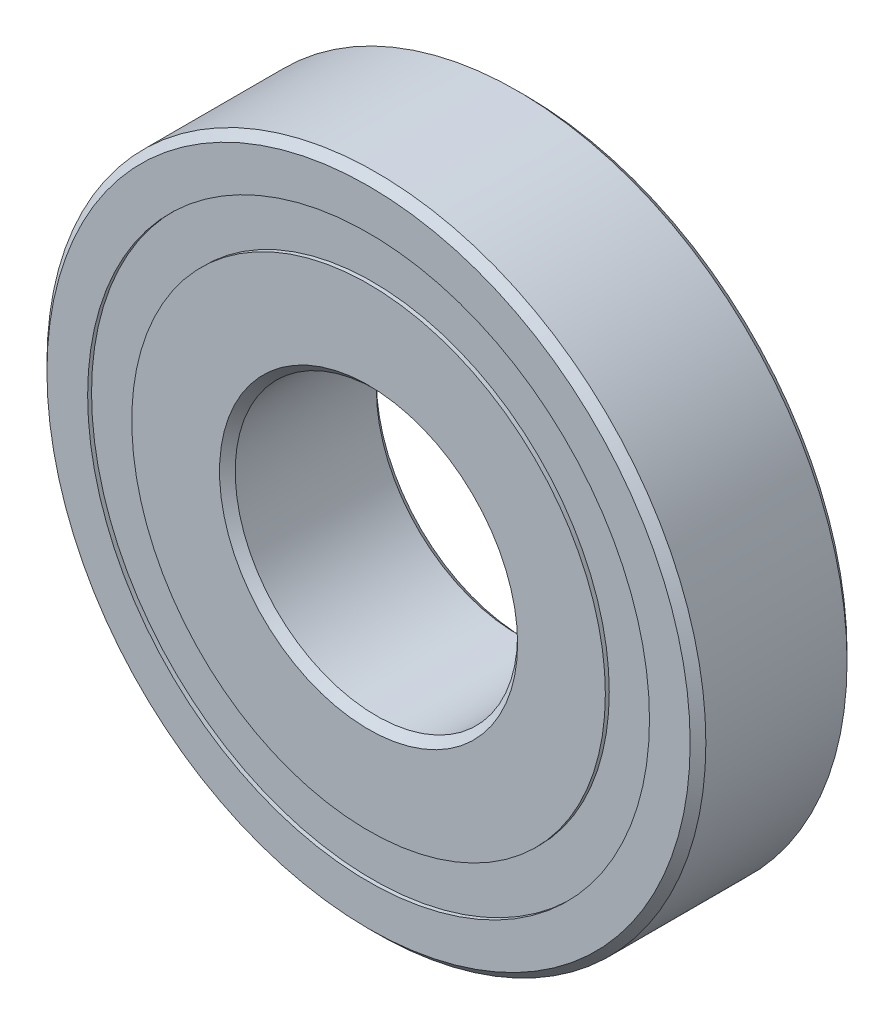
ISO-10303-21;
HEADER;
FILE_DESCRIPTION(('STEP AP214'),'2;1');
FILE_NAME('part.step','',(''),(''),'','','');
FILE_SCHEMA(('AUTOMOTIVE_DESIGN { 1 0 10303 214 1 1 1 1 }'));
ENDSEC;
DATA;
#1=APPLICATION_CONTEXT('core data for automotive mechanical design processes');
#2=APPLICATION_PROTOCOL_DEFINITION('international standard','automotive_design',2000,#1);
#3=PRODUCT_CONTEXT('',#1,'mechanical');
#4=PRODUCT('Part','Part','',(#3));
#5=PRODUCT_RELATED_PRODUCT_CATEGORY('part','',(#4));
#6=PRODUCT_DEFINITION_FORMATION('','',#4);
#7=PRODUCT_DEFINITION_CONTEXT('part definition',#1,'design');
#8=PRODUCT_DEFINITION('design','',#6,#7);
#9=PRODUCT_DEFINITION_SHAPE('','',#8);
#10=(LENGTH_UNIT() NAMED_UNIT(*) SI_UNIT(.MILLI.,.METRE.));
#11=(NAMED_UNIT(*) PLANE_ANGLE_UNIT() SI_UNIT($,.RADIAN.));
#12=(NAMED_UNIT(*) SI_UNIT($,.STERADIAN.) SOLID_ANGLE_UNIT());
#13=UNCERTAINTY_MEASURE_WITH_UNIT(LENGTH_MEASURE(1.E-05),#10,'distance_accuracy_value','');
#14=(GEOMETRIC_REPRESENTATION_CONTEXT(3) GLOBAL_UNCERTAINTY_ASSIGNED_CONTEXT((#13)) GLOBAL_UNIT_ASSIGNED_CONTEXT((#10,
#11,#12)) REPRESENTATION_CONTEXT('',''));
#15=CARTESIAN_POINT('',(0.,0.,0.));
#16=DIRECTION('',(0.,0.,1.));
#17=DIRECTION('',(1.,0.,0.));
#18=AXIS2_PLACEMENT_3D('',#15,#16,#17);
#19=CARTESIAN_POINT('',(-7.14470958122166,-4.12499999999993,0.));
#20=DIRECTION('',(-0.866025403784443,-0.499999999999992,0.));
#21=DIRECTION('',(0.,0.,-1.));
#22=AXIS2_PLACEMENT_3D('',#19,#20,#21);
#23=SPHERICAL_SURFACE('',#22,1.31498827146959);
#24=CARTESIAN_POINT('',(-8.28352282999291,-4.78249413573472,0.));
#25=VERTEX_POINT('',#24);
#26=VERTEX_LOOP('',#25);
#27=FACE_BOUND('',#26,.T.);
#28=CARTESIAN_POINT('',(-6.0058963324504,-3.46750586426515,0.));
#29=VERTEX_POINT('',#28);
#30=VERTEX_LOOP('',#29);
#31=FACE_BOUND('',#30,.T.);
#32=ADVANCED_FACE('P0_F15',(#27,#31),#23,.T.);
#33=CLOSED_SHELL('',(#32));
#34=MANIFOLD_SOLID_BREP('P0_B1',#33);
#35=CARTESIAN_POINT('',(-4.12499999999991,7.14470958122167,0.));
#36=DIRECTION('',(-0.499999999999989,0.866025403784445,0.));
#37=DIRECTION('',(0.,0.,-1.));
#38=AXIS2_PLACEMENT_3D('',#35,#36,#37);
#39=SPHERICAL_SURFACE('',#38,1.31498827146959);
#40=CARTESIAN_POINT('',(-4.78249413573469,8.28352282999293,0.));
#41=VERTEX_POINT('',#40);
#42=VERTEX_LOOP('',#41);
#43=FACE_BOUND('',#42,.T.);
#44=CARTESIAN_POINT('',(-3.46750586426513,6.00589633245041,0.));
#45=VERTEX_POINT('',#44);
#46=VERTEX_LOOP('',#45);
#47=FACE_BOUND('',#46,.T.);
#48=ADVANCED_FACE('P1_F15',(#43,#47),#39,.T.);
#49=CLOSED_SHELL('',(#48));
#50=MANIFOLD_SOLID_BREP('P1_B1',#49);
#51=CARTESIAN_POINT('',(4.12500000000001,7.14470958122162,0.));
#52=DIRECTION('',(0.500000000000001,0.866025403784438,0.));
#53=DIRECTION('',(0.,0.,-1.));
#54=AXIS2_PLACEMENT_3D('',#51,#52,#53);
#55=SPHERICAL_SURFACE('',#54,1.31498827146959);
#56=CARTESIAN_POINT('',(3.46750586426521,6.00589633245036,0.));
#57=VERTEX_POINT('',#56);
#58=VERTEX_LOOP('',#57);
#59=FACE_BOUND('',#58,.T.);
#60=CARTESIAN_POINT('',(4.78249413573481,8.28352282999287,0.));
#61=VERTEX_POINT('',#60);
#62=VERTEX_LOOP('',#61);
#63=FACE_BOUND('',#62,.T.);
#64=ADVANCED_FACE('P2_F15',(#59,#63),#55,.T.);
#65=CLOSED_SHELL('',(#64));
#66=MANIFOLD_SOLID_BREP('P2_B1',#65);
#67=CARTESIAN_POINT('',(-7.14470958122157,4.12500000000008,0.));
#68=DIRECTION('',(-0.866025403784433,0.500000000000011,0.));
#69=DIRECTION('',(0.,0.,-1.));
#70=AXIS2_PLACEMENT_3D('',#67,#68,#69);
#71=SPHERICAL_SURFACE('',#70,1.31498827146959);
#72=CARTESIAN_POINT('',(-6.00589633245033,3.46750586426528,0.));
#73=VERTEX_POINT('',#72);
#74=VERTEX_LOOP('',#73);
#75=FACE_BOUND('',#74,.T.);
#76=CARTESIAN_POINT('',(-8.28352282999281,4.78249413573489,0.));
#77=VERTEX_POINT('',#76);
#78=VERTEX_LOOP('',#77);
#79=FACE_BOUND('',#78,.T.);
#80=ADVANCED_FACE('P3_F15',(#75,#79),#71,.T.);
#81=CLOSED_SHELL('',(#80));
#82=MANIFOLD_SOLID_BREP('P3_B1',#81);
#83=CARTESIAN_POINT('',(0.,8.9532967032967,-1.31498827146959));
#84=DIRECTION('',(0.,0.,-1.));
#85=DIRECTION('',(-1.,0.,0.));
#86=AXIS2_PLACEMENT_3D('',#83,#84,#85);
#87=PLANE('',#86);
#88=CARTESIAN_POINT('',(0.,0.,-1.31498827146959));
#89=DIRECTION('',(0.,0.,1.));
#90=DIRECTION('',(1.,0.,0.));
#91=AXIS2_PLACEMENT_3D('',#88,#89,#90);
#92=CIRCLE('',#91,8.9532967032967);
#93=CARTESIAN_POINT('',(8.9532967032967,0.,-1.31498827146959));
#94=VERTEX_POINT('',#93);
#95=EDGE_CURVE('P4_E17',#94,#94,#92,.F.);
#96=ORIENTED_EDGE('',*,*,#95,.F.);
#97=EDGE_LOOP('',(#96));
#98=FACE_BOUND('',#97,.T.);
#99=CARTESIAN_POINT('',(0.,0.,-1.31498827146959));
#100=DIRECTION('',(0.,0.,1.));
#101=DIRECTION('',(1.,0.,0.));
#102=AXIS2_PLACEMENT_3D('',#99,#100,#101);
#103=CIRCLE('',#102,7.5467032967033);
#104=CARTESIAN_POINT('',(7.5467032967033,0.,-1.31498827146959));
#105=VERTEX_POINT('',#104);
#106=EDGE_CURVE('P4_E26',#105,#105,#103,.F.);
#107=ORIENTED_EDGE('',*,*,#106,.T.);
#108=EDGE_LOOP('',(#107));
#109=FACE_BOUND('',#108,.T.);
#110=ADVANCED_FACE('P4_F14',(#98,#109),#87,.F.);
#111=CARTESIAN_POINT('',(0.,0.,2.5));
#112=DIRECTION('',(0.,0.,1.));
#113=DIRECTION('',(1.,0.,0.));
#114=AXIS2_PLACEMENT_3D('',#111,#112,#113);
#115=CYLINDRICAL_SURFACE('',#114,8.9532967032967);
#116=ORIENTED_EDGE('',*,*,#95,.T.);
#117=EDGE_LOOP('',(#116));
#118=FACE_BOUND('',#117,.T.);
#119=CARTESIAN_POINT('',(0.,0.,-2.375));
#120=DIRECTION('',(0.,0.,1.));
#121=DIRECTION('',(1.,0.,0.));
#122=AXIS2_PLACEMENT_3D('',#119,#120,#121);
#123=CIRCLE('',#122,8.9532967032967);
#124=CARTESIAN_POINT('',(8.9532967032967,0.,-2.375));
#125=VERTEX_POINT('',#124);
#126=EDGE_CURVE('P4_E21',#125,#125,#123,.T.);
#127=ORIENTED_EDGE('',*,*,#126,.T.);
#128=EDGE_LOOP('',(#127));
#129=FACE_BOUND('',#128,.T.);
#130=ADVANCED_FACE('P4_F34',(#118,#129),#115,.T.);
#131=CARTESIAN_POINT('',(0.,0.,2.5));
#132=DIRECTION('',(0.,0.,1.));
#133=DIRECTION('',(1.,0.,0.));
#134=AXIS2_PLACEMENT_3D('',#131,#132,#133);
#135=CYLINDRICAL_SURFACE('',#134,7.5467032967033);
#136=CARTESIAN_POINT('',(0.,0.,-2.375));
#137=DIRECTION('',(0.,0.,1.));
#138=DIRECTION('',(1.,0.,0.));
#139=AXIS2_PLACEMENT_3D('',#136,#137,#138);
#140=CIRCLE('',#139,7.5467032967033);
#141=CARTESIAN_POINT('',(7.5467032967033,0.,-2.375));
#142=VERTEX_POINT('',#141);
#143=EDGE_CURVE('P4_E10',#142,#142,#140,.F.);
#144=ORIENTED_EDGE('',*,*,#143,.T.);
#145=EDGE_LOOP('',(#144));
#146=FACE_BOUND('',#145,.T.);
#147=ORIENTED_EDGE('',*,*,#106,.F.);
#148=EDGE_LOOP('',(#147));
#149=FACE_BOUND('',#148,.T.);
#150=ADVANCED_FACE('P4_F42',(#146,#149),#135,.F.);
#151=CARTESIAN_POINT('',(0.,8.9532967032967,-2.375));
#152=DIRECTION('',(0.,0.,1.));
#153=DIRECTION('',(1.,0.,0.));
#154=AXIS2_PLACEMENT_3D('',#151,#152,#153);
#155=PLANE('',#154);
#156=ORIENTED_EDGE('',*,*,#143,.F.);
#157=EDGE_LOOP('',(#156));
#158=FACE_BOUND('',#157,.T.);
#159=ORIENTED_EDGE('',*,*,#126,.F.);
#160=EDGE_LOOP('',(#159));
#161=FACE_BOUND('',#160,.T.);
#162=ADVANCED_FACE('P4_F43',(#158,#161),#155,.F.);
#163=CLOSED_SHELL('',(#110,#130,#150,#162));
#164=MANIFOLD_SOLID_BREP('P4_B1',#163);
#165=CARTESIAN_POINT('',(0.,0.,0.));
#166=DIRECTION('',(0.,0.,1.));
#167=DIRECTION('',(1.,0.,0.));
#168=AXIS2_PLACEMENT_3D('',#165,#166,#167);
#169=TOROIDAL_SURFACE('',#168,8.25,1.31498827146959);
#170=CARTESIAN_POINT('',(0.,0.,-1.11111111111111));
#171=DIRECTION('',(0.,0.,1.));
#172=DIRECTION('',(1.,0.,0.));
#173=AXIS2_PLACEMENT_3D('',#170,#171,#172);
#174=CIRCLE('',#173,8.9532967032967);
#175=CARTESIAN_POINT('',(8.9532967032967,0.,-1.11111111111111));
#176=VERTEX_POINT('',#175);
#177=EDGE_CURVE('P5_E32',#176,#176,#174,.F.);
#178=ORIENTED_EDGE('',*,*,#177,.T.);
#179=EDGE_LOOP('',(#178));
#180=FACE_BOUND('',#179,.T.);
#181=CARTESIAN_POINT('',(0.,0.,1.11111111111111));
#182=DIRECTION('',(0.,0.,1.));
#183=DIRECTION('',(1.,0.,0.));
#184=AXIS2_PLACEMENT_3D('',#181,#182,#183);
#185=CIRCLE('',#184,8.9532967032967);
#186=CARTESIAN_POINT('',(8.9532967032967,0.,1.11111111111111));
#187=VERTEX_POINT('',#186);
#188=EDGE_CURVE('P5_E30',#187,#187,#185,.T.);
#189=ORIENTED_EDGE('',*,*,#188,.T.);
#190=EDGE_LOOP('',(#189));
#191=FACE_BOUND('',#190,.T.);
#192=ADVANCED_FACE('P5_F14',(#180,#191),#169,.F.);
#193=CARTESIAN_POINT('',(0.,0.,2.5));
#194=DIRECTION('',(0.,0.,1.));
#195=DIRECTION('',(1.,0.,0.));
#196=AXIS2_PLACEMENT_3D('',#193,#194,#195);
#197=CYLINDRICAL_SURFACE('',#196,8.9532967032967);
#198=CARTESIAN_POINT('',(0.,0.,-2.50000000000001));
#199=DIRECTION('',(0.,0.,1.));
#200=DIRECTION('',(1.,0.,0.));
#201=AXIS2_PLACEMENT_3D('',#198,#199,#200);
#202=CIRCLE('',#201,8.9532967032967);
#203=CARTESIAN_POINT('',(8.9532967032967,0.,-2.50000000000001));
#204=VERTEX_POINT('',#203);
#205=EDGE_CURVE('P5_E18',#204,#204,#202,.F.);
#206=ORIENTED_EDGE('',*,*,#205,.T.);
#207=EDGE_LOOP('',(#206));
#208=FACE_BOUND('',#207,.T.);
#209=ORIENTED_EDGE('',*,*,#177,.F.);
#210=EDGE_LOOP('',(#209));
#211=FACE_BOUND('',#210,.T.);
#212=ADVANCED_FACE('P5_F48',(#208,#211),#197,.F.);
#213=CARTESIAN_POINT('',(0.,0.,2.5));
#214=DIRECTION('',(0.,0.,1.));
#215=DIRECTION('',(1.,0.,0.));
#216=AXIS2_PLACEMENT_3D('',#213,#214,#215);
#217=CYLINDRICAL_SURFACE('',#216,8.9532967032967);
#218=ORIENTED_EDGE('',*,*,#188,.F.);
#219=EDGE_LOOP('',(#218));
#220=FACE_BOUND('',#219,.T.);
#221=CARTESIAN_POINT('',(0.,0.,2.5));
#222=DIRECTION('',(0.,0.,1.));
#223=DIRECTION('',(1.,0.,0.));
#224=AXIS2_PLACEMENT_3D('',#221,#222,#223);
#225=CIRCLE('',#224,8.9532967032967);
#226=CARTESIAN_POINT('',(8.9532967032967,0.,2.5));
#227=VERTEX_POINT('',#226);
#228=EDGE_CURVE('P5_E41',#227,#227,#225,.T.);
#229=ORIENTED_EDGE('',*,*,#228,.T.);
#230=EDGE_LOOP('',(#229));
#231=FACE_BOUND('',#230,.T.);
#232=ADVANCED_FACE('P5_F55',(#220,#231),#217,.F.);
#233=CARTESIAN_POINT('',(0.,10.25,-2.50000000000001));
#234=DIRECTION('',(0.,0.,1.));
#235=DIRECTION('',(1.,0.,0.));
#236=AXIS2_PLACEMENT_3D('',#233,#234,#235);
#237=PLANE('',#236);
#238=ORIENTED_EDGE('',*,*,#205,.F.);
#239=EDGE_LOOP('',(#238));
#240=FACE_BOUND('',#239,.T.);
#241=CARTESIAN_POINT('',(0.,0.,-2.50000000000001));
#242=DIRECTION('',(0.,0.,1.));
#243=DIRECTION('',(1.,0.,0.));
#244=AXIS2_PLACEMENT_3D('',#241,#242,#243);
#245=CIRCLE('',#244,10.25);
#246=CARTESIAN_POINT('',(10.25,0.,-2.50000000000001));
#247=VERTEX_POINT('',#246);
#248=EDGE_CURVE('P5_E39',#247,#247,#245,.T.);
#249=ORIENTED_EDGE('',*,*,#248,.F.);
#250=EDGE_LOOP('',(#249));
#251=FACE_BOUND('',#250,.T.);
#252=ADVANCED_FACE('P5_F51',(#240,#251),#237,.F.);
#253=CARTESIAN_POINT('',(0.,10.25,2.5));
#254=DIRECTION('',(0.,0.,-1.));
#255=DIRECTION('',(-1.,0.,0.));
#256=AXIS2_PLACEMENT_3D('',#253,#254,#255);
#257=PLANE('',#256);
#258=CARTESIAN_POINT('',(0.,0.,2.5));
#259=DIRECTION('',(0.,0.,-1.));
#260=DIRECTION('',(-1.,0.,0.));
#261=AXIS2_PLACEMENT_3D('',#258,#259,#260);
#262=CIRCLE('',#261,10.25);
#263=CARTESIAN_POINT('',(-10.25,0.,2.5));
#264=VERTEX_POINT('',#263);
#265=EDGE_CURVE('P5_E27',#264,#264,#262,.T.);
#266=ORIENTED_EDGE('',*,*,#265,.F.);
#267=EDGE_LOOP('',(#266));
#268=FACE_BOUND('',#267,.T.);
#269=ORIENTED_EDGE('',*,*,#228,.F.);
#270=EDGE_LOOP('',(#269));
#271=FACE_BOUND('',#270,.T.);
#272=ADVANCED_FACE('P5_F54',(#268,#271),#257,.F.);
#273=CARTESIAN_POINT('',(0.,0.,-2.25000000000001));
#274=DIRECTION('',(0.,0.,1.));
#275=DIRECTION('',(1.,0.,0.));
#276=AXIS2_PLACEMENT_3D('',#273,#274,#275);
#277=CONICAL_SURFACE('',#276,10.5,0.785398163397449);
#278=CARTESIAN_POINT('',(0.,0.,-2.25000000000001));
#279=DIRECTION('',(0.,0.,1.));
#280=DIRECTION('',(1.,0.,0.));
#281=AXIS2_PLACEMENT_3D('',#278,#279,#280);
#282=CIRCLE('',#281,10.5);
#283=CARTESIAN_POINT('',(10.5,0.,-2.25000000000001));
#284=VERTEX_POINT('',#283);
#285=EDGE_CURVE('P5_E22',#284,#284,#282,.T.);
#286=ORIENTED_EDGE('',*,*,#285,.F.);
#287=EDGE_LOOP('',(#286));
#288=FACE_BOUND('',#287,.T.);
#289=ORIENTED_EDGE('',*,*,#248,.T.);
#290=EDGE_LOOP('',(#289));
#291=FACE_BOUND('',#290,.T.);
#292=ADVANCED_FACE('P5_F59',(#288,#291),#277,.T.);
#293=CARTESIAN_POINT('',(0.,0.,2.25));
#294=DIRECTION('',(0.,0.,-1.));
#295=DIRECTION('',(-1.,0.,0.));
#296=AXIS2_PLACEMENT_3D('',#293,#294,#295);
#297=CONICAL_SURFACE('',#296,10.5,0.785398163397448);
#298=CARTESIAN_POINT('',(0.,0.,2.25));
#299=DIRECTION('',(0.,0.,1.));
#300=DIRECTION('',(1.,0.,0.));
#301=AXIS2_PLACEMENT_3D('',#298,#299,#300);
#302=CIRCLE('',#301,10.5);
#303=CARTESIAN_POINT('',(10.5,0.,2.25));
#304=VERTEX_POINT('',#303);
#305=EDGE_CURVE('P5_E10',#304,#304,#302,.F.);
#306=ORIENTED_EDGE('',*,*,#305,.F.);
#307=EDGE_LOOP('',(#306));
#308=FACE_BOUND('',#307,.T.);
#309=ORIENTED_EDGE('',*,*,#265,.T.);
#310=EDGE_LOOP('',(#309));
#311=FACE_BOUND('',#310,.T.);
#312=ADVANCED_FACE('P5_F61',(#308,#311),#297,.T.);
#313=CARTESIAN_POINT('',(0.,0.,2.5));
#314=DIRECTION('',(0.,0.,1.));
#315=DIRECTION('',(1.,0.,0.));
#316=AXIS2_PLACEMENT_3D('',#313,#314,#315);
#317=CYLINDRICAL_SURFACE('',#316,10.5);
#318=ORIENTED_EDGE('',*,*,#305,.T.);
#319=EDGE_LOOP('',(#318));
#320=FACE_BOUND('',#319,.T.);
#321=ORIENTED_EDGE('',*,*,#285,.T.);
#322=EDGE_LOOP('',(#321));
#323=FACE_BOUND('',#322,.T.);
#324=ADVANCED_FACE('P5_F69',(#320,#323),#317,.T.);
#325=CLOSED_SHELL('',(#192,#212,#232,#252,#272,#292,#312,#324));
#326=MANIFOLD_SOLID_BREP('P5_B1',#325);
#327=CARTESIAN_POINT('',(-8.25,0.,0.));
#328=DIRECTION('',(-1.,0.,0.));
#329=DIRECTION('',(0.,0.,-1.));
#330=AXIS2_PLACEMENT_3D('',#327,#328,#329);
#331=SPHERICAL_SURFACE('',#330,1.31498827146959);
#332=CARTESIAN_POINT('',(-9.56498827146959,1.00187934168269E-13,0.));
#333=VERTEX_POINT('',#332);
#334=VERTEX_LOOP('',#333);
#335=FACE_BOUND('',#334,.T.);
#336=CARTESIAN_POINT('',(-6.93501172853041,0.,0.));
#337=VERTEX_POINT('',#336);
#338=VERTEX_LOOP('',#337);
#339=FACE_BOUND('',#338,.T.);
#340=ADVANCED_FACE('P6_F15',(#335,#339),#331,.T.);
#341=CLOSED_SHELL('',(#340));
#342=MANIFOLD_SOLID_BREP('P6_B1',#341);
#343=CARTESIAN_POINT('',(7.14470958122163,4.12499999999998,0.));
#344=DIRECTION('',(0.86602540378444,0.499999999999998,0.));
#345=DIRECTION('',(0.,0.,-1.));
#346=AXIS2_PLACEMENT_3D('',#343,#344,#345);
#347=SPHERICAL_SURFACE('',#346,1.31498827146959);
#348=CARTESIAN_POINT('',(8.28352282999288,4.78249413573478,0.));
#349=VERTEX_POINT('',#348);
#350=VERTEX_LOOP('',#349);
#351=FACE_BOUND('',#350,.T.);
#352=CARTESIAN_POINT('',(6.00589633245038,3.46750586426519,0.));
#353=VERTEX_POINT('',#352);
#354=VERTEX_LOOP('',#353);
#355=FACE_BOUND('',#354,.T.);
#356=ADVANCED_FACE('P7_F15',(#351,#355),#347,.T.);
#357=CLOSED_SHELL('',(#356));
#358=MANIFOLD_SOLID_BREP('P7_B1',#357);
#359=CARTESIAN_POINT('',(8.25,0.,0.));
#360=DIRECTION('',(1.,0.,0.));
#361=DIRECTION('',(0.,0.,-1.));
#362=AXIS2_PLACEMENT_3D('',#359,#360,#361);
#363=SPHERICAL_SURFACE('',#362,1.31498827146959);
#364=CARTESIAN_POINT('',(6.93501172853041,0.,0.));
#365=VERTEX_POINT('',#364);
#366=VERTEX_LOOP('',#365);
#367=FACE_BOUND('',#366,.T.);
#368=CARTESIAN_POINT('',(9.56498827146959,0.,0.));
#369=VERTEX_POINT('',#368);
#370=VERTEX_LOOP('',#369);
#371=FACE_BOUND('',#370,.T.);
#372=ADVANCED_FACE('P8_F15',(#367,#371),#363,.T.);
#373=CLOSED_SHELL('',(#372));
#374=MANIFOLD_SOLID_BREP('P8_B1',#373);
#375=CARTESIAN_POINT('',(0.,8.9532967032967,2.37499999999999));
#376=DIRECTION('',(0.,0.,-1.));
#377=DIRECTION('',(-1.,0.,0.));
#378=AXIS2_PLACEMENT_3D('',#375,#376,#377);
#379=PLANE('',#378);
#380=CARTESIAN_POINT('',(0.,0.,2.37499999999999));
#381=DIRECTION('',(0.,0.,1.));
#382=DIRECTION('',(1.,0.,0.));
#383=AXIS2_PLACEMENT_3D('',#380,#381,#382);
#384=CIRCLE('',#383,8.9532967032967);
#385=CARTESIAN_POINT('',(8.9532967032967,0.,2.37499999999999));
#386=VERTEX_POINT('',#385);
#387=EDGE_CURVE('P9_E17',#386,#386,#384,.F.);
#388=ORIENTED_EDGE('',*,*,#387,.F.);
#389=EDGE_LOOP('',(#388));
#390=FACE_BOUND('',#389,.T.);
#391=CARTESIAN_POINT('',(0.,0.,2.37499999999999));
#392=DIRECTION('',(0.,0.,1.));
#393=DIRECTION('',(1.,0.,0.));
#394=AXIS2_PLACEMENT_3D('',#391,#392,#393);
#395=CIRCLE('',#394,7.5467032967033);
#396=CARTESIAN_POINT('',(7.5467032967033,0.,2.37499999999999));
#397=VERTEX_POINT('',#396);
#398=EDGE_CURVE('P9_E26',#397,#397,#395,.F.);
#399=ORIENTED_EDGE('',*,*,#398,.T.);
#400=EDGE_LOOP('',(#399));
#401=FACE_BOUND('',#400,.T.);
#402=ADVANCED_FACE('P9_F14',(#390,#401),#379,.F.);
#403=CARTESIAN_POINT('',(0.,0.,2.5));
#404=DIRECTION('',(0.,0.,1.));
#405=DIRECTION('',(1.,0.,0.));
#406=AXIS2_PLACEMENT_3D('',#403,#404,#405);
#407=CYLINDRICAL_SURFACE('',#406,8.9532967032967);
#408=ORIENTED_EDGE('',*,*,#387,.T.);
#409=EDGE_LOOP('',(#408));
#410=FACE_BOUND('',#409,.T.);
#411=CARTESIAN_POINT('',(0.,0.,1.31498827146959));
#412=DIRECTION('',(0.,0.,1.));
#413=DIRECTION('',(1.,0.,0.));
#414=AXIS2_PLACEMENT_3D('',#411,#412,#413);
#415=CIRCLE('',#414,8.9532967032967);
#416=CARTESIAN_POINT('',(8.9532967032967,0.,1.31498827146959));
#417=VERTEX_POINT('',#416);
#418=EDGE_CURVE('P9_E21',#417,#417,#415,.T.);
#419=ORIENTED_EDGE('',*,*,#418,.T.);
#420=EDGE_LOOP('',(#419));
#421=FACE_BOUND('',#420,.T.);
#422=ADVANCED_FACE('P9_F34',(#410,#421),#407,.T.);
#423=CARTESIAN_POINT('',(0.,0.,2.5));
#424=DIRECTION('',(0.,0.,1.));
#425=DIRECTION('',(1.,0.,0.));
#426=AXIS2_PLACEMENT_3D('',#423,#424,#425);
#427=CYLINDRICAL_SURFACE('',#426,7.5467032967033);
#428=CARTESIAN_POINT('',(0.,0.,1.31498827146958));
#429=DIRECTION('',(0.,0.,1.));
#430=DIRECTION('',(1.,0.,0.));
#431=AXIS2_PLACEMENT_3D('',#428,#429,#430);
#432=CIRCLE('',#431,7.5467032967033);
#433=CARTESIAN_POINT('',(7.5467032967033,0.,1.31498827146958));
#434=VERTEX_POINT('',#433);
#435=EDGE_CURVE('P9_E10',#434,#434,#432,.F.);
#436=ORIENTED_EDGE('',*,*,#435,.T.);
#437=EDGE_LOOP('',(#436));
#438=FACE_BOUND('',#437,.T.);
#439=ORIENTED_EDGE('',*,*,#398,.F.);
#440=EDGE_LOOP('',(#439));
#441=FACE_BOUND('',#440,.T.);
#442=ADVANCED_FACE('P9_F42',(#438,#441),#427,.F.);
#443=CARTESIAN_POINT('',(0.,8.9532967032967,1.31498827146958));
#444=DIRECTION('',(0.,0.,1.));
#445=DIRECTION('',(1.,0.,0.));
#446=AXIS2_PLACEMENT_3D('',#443,#444,#445);
#447=PLANE('',#446);
#448=ORIENTED_EDGE('',*,*,#435,.F.);
#449=EDGE_LOOP('',(#448));
#450=FACE_BOUND('',#449,.T.);
#451=ORIENTED_EDGE('',*,*,#418,.F.);
#452=EDGE_LOOP('',(#451));
#453=FACE_BOUND('',#452,.T.);
#454=ADVANCED_FACE('P9_F43',(#450,#453),#447,.F.);
#455=CLOSED_SHELL('',(#402,#422,#442,#454));
#456=MANIFOLD_SOLID_BREP('P9_B1',#455);
#457=CARTESIAN_POINT('',(7.1447095812216,-4.12500000000003,0.));
#458=DIRECTION('',(0.866025403784437,-0.500000000000004,0.));
#459=DIRECTION('',(0.,0.,-1.));
#460=AXIS2_PLACEMENT_3D('',#457,#458,#459);
#461=SPHERICAL_SURFACE('',#460,1.31498827146959);
#462=CARTESIAN_POINT('',(6.00589633245035,-3.46750586426523,0.));
#463=VERTEX_POINT('',#462);
#464=VERTEX_LOOP('',#463);
#465=FACE_BOUND('',#464,.T.);
#466=CARTESIAN_POINT('',(8.28352282999285,-4.78249413573483,0.));
#467=VERTEX_POINT('',#466);
#468=VERTEX_LOOP('',#467);
#469=FACE_BOUND('',#468,.T.);
#470=ADVANCED_FACE('P10_F15',(#465,#469),#461,.T.);
#471=CLOSED_SHELL('',(#470));
#472=MANIFOLD_SOLID_BREP('P10_B1',#471);
#473=CARTESIAN_POINT('',(0.,4.75,-2.50000000000001));
#474=DIRECTION('',(0.,0.,1.));
#475=DIRECTION('',(1.,0.,0.));
#476=AXIS2_PLACEMENT_3D('',#473,#474,#475);
#477=PLANE('',#476);
#478=CARTESIAN_POINT('',(0.,0.,-2.49999999999773));
#479=DIRECTION('',(0.,0.,-1.));
#480=DIRECTION('',(-1.,0.,0.));
#481=AXIS2_PLACEMENT_3D('',#478,#479,#480);
#482=CIRCLE('',#481,4.75000000000136);
#483=CARTESIAN_POINT('',(-4.75000000000136,0.,-2.49999999999773));
#484=VERTEX_POINT('',#483);
#485=EDGE_CURVE('P11_E31',#484,#484,#482,.F.);
#486=ORIENTED_EDGE('',*,*,#485,.T.);
#487=EDGE_LOOP('',(#486));
#488=FACE_BOUND('',#487,.T.);
#489=CARTESIAN_POINT('',(0.,0.,-2.50000000000001));
#490=DIRECTION('',(0.,0.,1.));
#491=DIRECTION('',(1.,0.,0.));
#492=AXIS2_PLACEMENT_3D('',#489,#490,#491);
#493=CIRCLE('',#492,7.5467032967033);
#494=CARTESIAN_POINT('',(7.5467032967033,0.,-2.50000000000001));
#495=VERTEX_POINT('',#494);
#496=EDGE_CURVE('P11_E17',#495,#495,#493,.T.);
#497=ORIENTED_EDGE('',*,*,#496,.F.);
#498=EDGE_LOOP('',(#497));
#499=FACE_BOUND('',#498,.T.);
#500=ADVANCED_FACE('P11_F14',(#488,#499),#477,.F.);
#501=CARTESIAN_POINT('',(0.,0.,2.5));
#502=DIRECTION('',(0.,0.,1.));
#503=DIRECTION('',(1.,0.,0.));
#504=AXIS2_PLACEMENT_3D('',#501,#502,#503);
#505=CYLINDRICAL_SURFACE('',#504,7.5467032967033);
#506=CARTESIAN_POINT('',(0.,0.,-1.11111111111111));
#507=DIRECTION('',(0.,0.,1.));
#508=DIRECTION('',(1.,0.,0.));
#509=AXIS2_PLACEMENT_3D('',#506,#507,#508);
#510=CIRCLE('',#509,7.5467032967033);
#511=CARTESIAN_POINT('',(7.5467032967033,0.,-1.11111111111111));
#512=VERTEX_POINT('',#511);
#513=EDGE_CURVE('P11_E29',#512,#512,#510,.F.);
#514=ORIENTED_EDGE('',*,*,#513,.T.);
#515=EDGE_LOOP('',(#514));
#516=FACE_BOUND('',#515,.T.);
#517=ORIENTED_EDGE('',*,*,#496,.T.);
#518=EDGE_LOOP('',(#517));
#519=FACE_BOUND('',#518,.T.);
#520=ADVANCED_FACE('P11_F40',(#516,#519),#505,.T.);
#521=CARTESIAN_POINT('',(0.,0.,-2.49999999999773));
#522=DIRECTION('',(0.,0.,-1.));
#523=DIRECTION('',(-1.,0.,0.));
#524=AXIS2_PLACEMENT_3D('',#521,#522,#523);
#525=CONICAL_SURFACE('',#524,4.75000000000136,0.785398163397448);
#526=CARTESIAN_POINT('',(0.,0.,-2.25000000000001));
#527=DIRECTION('',(0.,0.,1.));
#528=DIRECTION('',(1.,0.,0.));
#529=AXIS2_PLACEMENT_3D('',#526,#527,#528);
#530=CIRCLE('',#529,4.5);
#531=CARTESIAN_POINT('',(4.5,0.,-2.25000000000001));
#532=VERTEX_POINT('',#531);
#533=EDGE_CURVE('P11_E36',#532,#532,#530,.T.);
#534=ORIENTED_EDGE('',*,*,#533,.T.);
#535=EDGE_LOOP('',(#534));
#536=FACE_BOUND('',#535,.T.);
#537=ORIENTED_EDGE('',*,*,#485,.F.);
#538=EDGE_LOOP('',(#537));
#539=FACE_BOUND('',#538,.T.);
#540=ADVANCED_FACE('P11_F47',(#536,#539),#525,.F.);
#541=CARTESIAN_POINT('',(0.,0.,2.5));
#542=DIRECTION('',(0.,0.,1.));
#543=DIRECTION('',(1.,0.,0.));
#544=AXIS2_PLACEMENT_3D('',#541,#542,#543);
#545=CYLINDRICAL_SURFACE('',#544,4.5);
#546=ORIENTED_EDGE('',*,*,#533,.F.);
#547=EDGE_LOOP('',(#546));
#548=FACE_BOUND('',#547,.T.);
#549=CARTESIAN_POINT('',(0.,0.,2.25000000000364));
#550=DIRECTION('',(0.,0.,1.));
#551=DIRECTION('',(1.,0.,0.));
#552=AXIS2_PLACEMENT_3D('',#549,#550,#551);
#553=CIRCLE('',#552,4.49999999995043);
#554=CARTESIAN_POINT('',(4.49999999995043,0.,2.25000000000364));
#555=VERTEX_POINT('',#554);
#556=EDGE_CURVE('P11_E74',#555,#555,#553,.T.);
#557=ORIENTED_EDGE('',*,*,#556,.T.);
#558=EDGE_LOOP('',(#557));
#559=FACE_BOUND('',#558,.T.);
#560=ADVANCED_FACE('P11_F68',(#548,#559),#545,.F.);
#561=CARTESIAN_POINT('',(0.,0.,0.));
#562=DIRECTION('',(0.,0.,1.));
#563=DIRECTION('',(1.,0.,0.));
#564=AXIS2_PLACEMENT_3D('',#561,#562,#563);
#565=TOROIDAL_SURFACE('',#564,8.25,1.31498827146958);
#566=ORIENTED_EDGE('',*,*,#513,.F.);
#567=EDGE_LOOP('',(#566));
#568=FACE_BOUND('',#567,.T.);
#569=CARTESIAN_POINT('',(0.,0.,1.11111111111111));
#570=DIRECTION('',(0.,0.,1.));
#571=DIRECTION('',(1.,0.,0.));
#572=AXIS2_PLACEMENT_3D('',#569,#570,#571);
#573=CIRCLE('',#572,7.5467032967033);
#574=CARTESIAN_POINT('',(7.5467032967033,0.,1.11111111111111));
#575=VERTEX_POINT('',#574);
#576=EDGE_CURVE('P11_E26',#575,#575,#573,.T.);
#577=ORIENTED_EDGE('',*,*,#576,.F.);
#578=EDGE_LOOP('',(#577));
#579=FACE_BOUND('',#578,.T.);
#580=ADVANCED_FACE('P11_F63',(#568,#579),#565,.F.);
#581=CARTESIAN_POINT('',(0.,0.,2.49999999988404));
#582=DIRECTION('',(0.,0.,1.));
#583=DIRECTION('',(1.,0.,0.));
#584=AXIS2_PLACEMENT_3D('',#581,#582,#583);
#585=CONICAL_SURFACE('',#584,4.74999999988768,0.785398163397448);
#586=ORIENTED_EDGE('',*,*,#556,.F.);
#587=EDGE_LOOP('',(#586));
#588=FACE_BOUND('',#587,.T.);
#589=CARTESIAN_POINT('',(0.,0.,2.49999999999773));
#590=DIRECTION('',(0.,0.,1.));
#591=DIRECTION('',(1.,0.,0.));
#592=AXIS2_PLACEMENT_3D('',#589,#590,#591);
#593=CIRCLE('',#592,4.75000000000136);
#594=CARTESIAN_POINT('',(4.75000000000136,0.,2.49999999999773));
#595=VERTEX_POINT('',#594);
#596=EDGE_CURVE('P11_E21',#595,#595,#593,.T.);
#597=ORIENTED_EDGE('',*,*,#596,.T.);
#598=EDGE_LOOP('',(#597));
#599=FACE_BOUND('',#598,.T.);
#600=ADVANCED_FACE('P11_F57',(#588,#599),#585,.F.);
#601=CARTESIAN_POINT('',(0.,0.,2.5));
#602=DIRECTION('',(0.,0.,1.));
#603=DIRECTION('',(1.,0.,0.));
#604=AXIS2_PLACEMENT_3D('',#601,#602,#603);
#605=CYLINDRICAL_SURFACE('',#604,7.5467032967033);
#606=CARTESIAN_POINT('',(0.,0.,2.50000000000001));
#607=DIRECTION('',(0.,0.,1.));
#608=DIRECTION('',(1.,0.,0.));
#609=AXIS2_PLACEMENT_3D('',#606,#607,#608);
#610=CIRCLE('',#609,7.5467032967033);
#611=CARTESIAN_POINT('',(7.5467032967033,0.,2.50000000000001));
#612=VERTEX_POINT('',#611);
#613=EDGE_CURVE('P11_E10',#612,#612,#610,.F.);
#614=ORIENTED_EDGE('',*,*,#613,.T.);
#615=EDGE_LOOP('',(#614));
#616=FACE_BOUND('',#615,.T.);
#617=ORIENTED_EDGE('',*,*,#576,.T.);
#618=EDGE_LOOP('',(#617));
#619=FACE_BOUND('',#618,.T.);
#620=ADVANCED_FACE('P11_F51',(#616,#619),#605,.T.);
#621=CARTESIAN_POINT('',(0.,4.75,2.5));
#622=DIRECTION('',(0.,0.,-1.));
#623=DIRECTION('',(-1.,0.,0.));
#624=AXIS2_PLACEMENT_3D('',#621,#622,#623);
#625=PLANE('',#624);
#626=ORIENTED_EDGE('',*,*,#613,.F.);
#627=EDGE_LOOP('',(#626));
#628=FACE_BOUND('',#627,.T.);
#629=ORIENTED_EDGE('',*,*,#596,.F.);
#630=EDGE_LOOP('',(#629));
#631=FACE_BOUND('',#630,.T.);
#632=ADVANCED_FACE('P11_F49',(#628,#631),#625,.F.);
#633=CLOSED_SHELL('',(#500,#520,#540,#560,#580,#600,#620,#632));
#634=MANIFOLD_SOLID_BREP('P11_B1',#633);
#635=CARTESIAN_POINT('',(0.,-8.25,0.));
#636=DIRECTION('',(0.,-1.,0.));
#637=DIRECTION('',(0.,0.,-1.));
#638=AXIS2_PLACEMENT_3D('',#635,#636,#637);
#639=SPHERICAL_SURFACE('',#638,1.31498827146959);
#640=CARTESIAN_POINT('',(0.,-9.56498827146959,0.));
#641=VERTEX_POINT('',#640);
#642=VERTEX_LOOP('',#641);
#643=FACE_BOUND('',#642,.T.);
#644=CARTESIAN_POINT('',(0.,-6.93501172853041,0.));
#645=VERTEX_POINT('',#644);
#646=VERTEX_LOOP('',#645);
#647=FACE_BOUND('',#646,.T.);
#648=ADVANCED_FACE('P12_F15',(#643,#647),#639,.T.);
#649=CLOSED_SHELL('',(#648));
#650=MANIFOLD_SOLID_BREP('P12_B1',#649);
#651=CARTESIAN_POINT('',(-4.12500000000006,-7.14470958122159,0.));
#652=DIRECTION('',(-0.500000000000007,-0.866025403784434,0.));
#653=DIRECTION('',(0.,0.,-1.));
#654=AXIS2_PLACEMENT_3D('',#651,#652,#653);
#655=SPHERICAL_SURFACE('',#654,1.31498827146959);
#656=CARTESIAN_POINT('',(-3.46750586426526,-6.00589633245034,0.));
#657=VERTEX_POINT('',#656);
#658=VERTEX_LOOP('',#657);
#659=FACE_BOUND('',#658,.T.);
#660=CARTESIAN_POINT('',(-4.78249413573486,-8.28352282999283,0.));
#661=VERTEX_POINT('',#660);
#662=VERTEX_LOOP('',#661);
#663=FACE_BOUND('',#662,.T.);
#664=ADVANCED_FACE('P13_F15',(#659,#663),#655,.T.);
#665=CLOSED_SHELL('',(#664));
#666=MANIFOLD_SOLID_BREP('P13_B1',#665);
#667=CARTESIAN_POINT('',(0.,8.25,0.));
#668=DIRECTION('',(0.,1.,0.));
#669=DIRECTION('',(0.,0.,-1.));
#670=AXIS2_PLACEMENT_3D('',#667,#668,#669);
#671=SPHERICAL_SURFACE('',#670,1.31498827146959);
#672=CARTESIAN_POINT('',(0.,9.56498827146959,0.));
#673=VERTEX_POINT('',#672);
#674=VERTEX_LOOP('',#673);
#675=FACE_BOUND('',#674,.T.);
#676=CARTESIAN_POINT('',(0.,6.93501172853041,0.));
#677=VERTEX_POINT('',#676);
#678=VERTEX_LOOP('',#677);
#679=FACE_BOUND('',#678,.T.);
#680=ADVANCED_FACE('P14_F15',(#675,#679),#671,.T.);
#681=CLOSED_SHELL('',(#680));
#682=MANIFOLD_SOLID_BREP('P14_B1',#681);
#683=CARTESIAN_POINT('',(4.12499999999996,-7.14470958122164,0.));
#684=DIRECTION('',(0.499999999999995,-0.866025403784441,0.));
#685=DIRECTION('',(0.,0.,-1.));
#686=AXIS2_PLACEMENT_3D('',#683,#684,#685);
#687=SPHERICAL_SURFACE('',#686,1.31498827146959);
#688=CARTESIAN_POINT('',(3.46750586426517,-6.00589633245039,0.));
#689=VERTEX_POINT('',#688);
#690=VERTEX_LOOP('',#689);
#691=FACE_BOUND('',#690,.T.);
#692=CARTESIAN_POINT('',(4.78249413573475,-8.2835228299929,0.));
#693=VERTEX_POINT('',#692);
#694=VERTEX_LOOP('',#693);
#695=FACE_BOUND('',#694,.T.);
#696=ADVANCED_FACE('P15_F15',(#691,#695),#687,.T.);
#697=CLOSED_SHELL('',(#696));
#698=MANIFOLD_SOLID_BREP('P15_B1',#697);
#699=ADVANCED_BREP_SHAPE_REPRESENTATION('',(#18,#34,#50,#66,#82,#164,#326,#342,#358,#374,#456,
#472,#634,#650,#666,#682,#698),#14);
#700=SHAPE_DEFINITION_REPRESENTATION(#9,#699);
ENDSEC;
END-ISO-10303-21;
